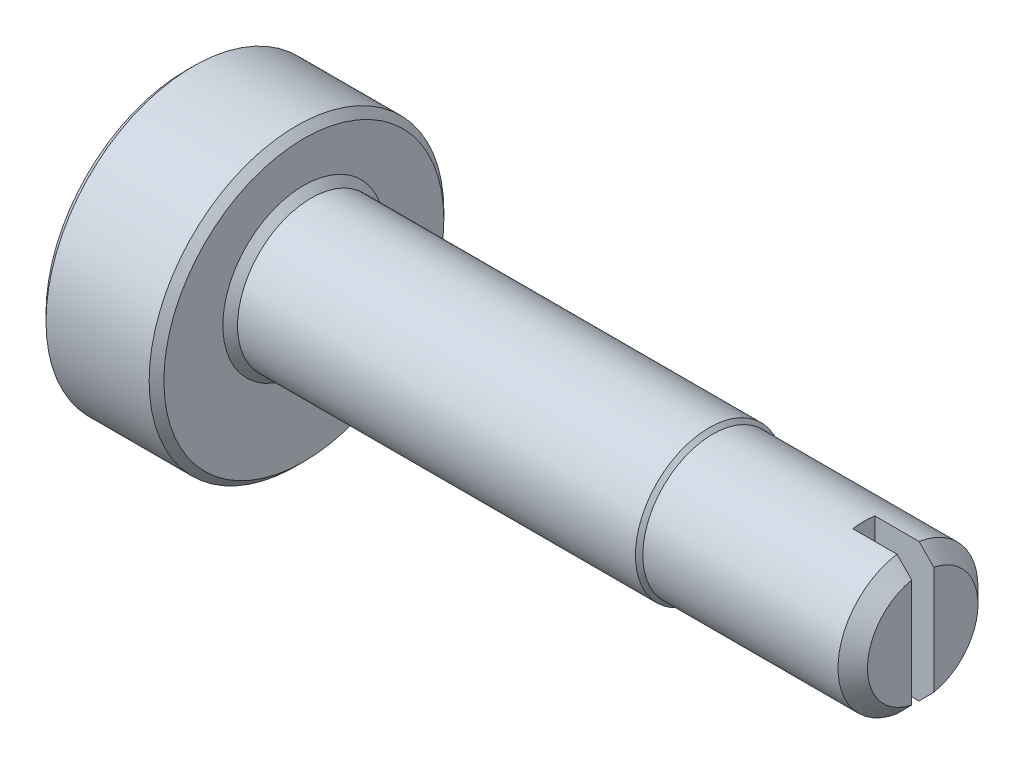
ISO-10303-21;
HEADER;
FILE_DESCRIPTION(('STEP AP214'),'2;1');
FILE_NAME('part.step','',(''),(''),'','','');
FILE_SCHEMA(('AUTOMOTIVE_DESIGN { 1 0 10303 214 1 1 1 1 }'));
ENDSEC;
DATA;
#1=APPLICATION_CONTEXT('core data for automotive mechanical design processes');
#2=APPLICATION_PROTOCOL_DEFINITION('international standard','automotive_design',2000,#1);
#3=PRODUCT_CONTEXT('',#1,'mechanical');
#4=PRODUCT('Part','Part','',(#3));
#5=PRODUCT_RELATED_PRODUCT_CATEGORY('part','',(#4));
#6=PRODUCT_DEFINITION_FORMATION('','',#4);
#7=PRODUCT_DEFINITION_CONTEXT('part definition',#1,'design');
#8=PRODUCT_DEFINITION('design','',#6,#7);
#9=PRODUCT_DEFINITION_SHAPE('','',#8);
#10=(LENGTH_UNIT() NAMED_UNIT(*) SI_UNIT(.MILLI.,.METRE.));
#11=(NAMED_UNIT(*) PLANE_ANGLE_UNIT() SI_UNIT($,.RADIAN.));
#12=(NAMED_UNIT(*) SI_UNIT($,.STERADIAN.) SOLID_ANGLE_UNIT());
#13=UNCERTAINTY_MEASURE_WITH_UNIT(LENGTH_MEASURE(1.E-05),#10,'distance_accuracy_value','');
#14=(GEOMETRIC_REPRESENTATION_CONTEXT(3) GLOBAL_UNCERTAINTY_ASSIGNED_CONTEXT((#13)) GLOBAL_UNIT_ASSIGNED_CONTEXT((#10,
#11,#12)) REPRESENTATION_CONTEXT('',''));
#15=CARTESIAN_POINT('',(0.,0.,0.));
#16=DIRECTION('',(0.,0.,1.));
#17=DIRECTION('',(1.,0.,0.));
#18=AXIS2_PLACEMENT_3D('',#15,#16,#17);
#19=CARTESIAN_POINT('',(10.,0.950000000000001,0.));
#20=DIRECTION('',(1.,0.,0.));
#21=DIRECTION('',(0.,0.,-1.));
#22=AXIS2_PLACEMENT_3D('',#19,#20,#21);
#23=PLANE('',#22);
#24=DIRECTION('',(0.,-1.,0.));
#25=VECTOR('',#24,1.);
#26=CARTESIAN_POINT('',(10.,0.,0.15));
#27=LINE('',#26,#25);
#28=CARTESIAN_POINT('',(10.,0.734846922834952,0.15));
#29=VERTEX_POINT('',#28);
#30=CARTESIAN_POINT('',(10.,-0.734846922834952,0.15));
#31=VERTEX_POINT('',#30);
#32=EDGE_CURVE('E381',#29,#31,#27,.T.);
#33=ORIENTED_EDGE('',*,*,#32,.F.);
#34=CARTESIAN_POINT('',(10.,0.,0.));
#35=DIRECTION('',(1.,0.,0.));
#36=DIRECTION('',(0.,0.,-1.));
#37=AXIS2_PLACEMENT_3D('',#34,#35,#36);
#38=CIRCLE('',#37,0.749999999999999);
#39=EDGE_CURVE('E382',#29,#31,#38,.T.);
#40=ORIENTED_EDGE('',*,*,#39,.T.);
#41=EDGE_LOOP('',(#33,#40));
#42=FACE_BOUND('',#41,.T.);
#43=ADVANCED_FACE('F202',(#42),#23,.T.);
#44=CARTESIAN_POINT('',(1.6,2.5,0.));
#45=DIRECTION('',(1.,0.,0.));
#46=DIRECTION('',(0.,0.,-1.));
#47=AXIS2_PLACEMENT_3D('',#44,#45,#46);
#48=PLANE('',#47);
#49=CARTESIAN_POINT('',(1.6,-0.25,0.));
#50=DIRECTION('',(1.,0.,0.));
#51=DIRECTION('',(0.,0.,-1.));
#52=AXIS2_PLACEMENT_3D('',#49,#50,#51);
#53=CIRCLE('',#52,1.9);
#54=CARTESIAN_POINT('',(1.6,-0.25,-1.9));
#55=VERTEX_POINT('',#54);
#56=EDGE_CURVE('E271',#55,#55,#53,.T.);
#57=ORIENTED_EDGE('',*,*,#56,.T.);
#58=EDGE_LOOP('',(#57));
#59=FACE_BOUND('',#58,.T.);
#60=CARTESIAN_POINT('',(1.6,0.,0.));
#61=DIRECTION('',(1.,0.,0.));
#62=DIRECTION('',(0.,0.,-1.));
#63=AXIS2_PLACEMENT_3D('',#60,#61,#62);
#64=CIRCLE('',#63,1.1);
#65=CARTESIAN_POINT('',(1.6,0.,-1.1));
#66=VERTEX_POINT('',#65);
#67=EDGE_CURVE('E419',#66,#66,#64,.T.);
#68=ORIENTED_EDGE('',*,*,#67,.F.);
#69=EDGE_LOOP('',(#68));
#70=FACE_BOUND('',#69,.T.);
#71=ADVANCED_FACE('F348',(#59,#70),#48,.T.);
#72=CARTESIAN_POINT('',(1.7,0.,0.));
#73=DIRECTION('',(-1.,0.,0.));
#74=DIRECTION('',(0.,0.,1.));
#75=AXIS2_PLACEMENT_3D('',#72,#73,#74);
#76=CONICAL_SURFACE('',#75,1.,0.785398163397448);
#77=ORIENTED_EDGE('',*,*,#67,.T.);
#78=EDGE_LOOP('',(#77));
#79=FACE_BOUND('',#78,.T.);
#80=CARTESIAN_POINT('',(1.7,0.,0.));
#81=DIRECTION('',(1.,0.,0.));
#82=DIRECTION('',(0.,0.,-1.));
#83=AXIS2_PLACEMENT_3D('',#80,#81,#82);
#84=CIRCLE('',#83,1.);
#85=CARTESIAN_POINT('',(1.7,0.,-1.));
#86=VERTEX_POINT('',#85);
#87=EDGE_CURVE('E416',#86,#86,#84,.T.);
#88=ORIENTED_EDGE('',*,*,#87,.F.);
#89=EDGE_LOOP('',(#88));
#90=FACE_BOUND('',#89,.T.);
#91=ADVANCED_FACE('F351',(#79,#90),#76,.T.);
#92=CARTESIAN_POINT('',(0.,0.,0.));
#93=DIRECTION('',(1.,0.,0.));
#94=DIRECTION('',(0.,0.,-1.));
#95=AXIS2_PLACEMENT_3D('',#92,#93,#94);
#96=CYLINDRICAL_SURFACE('',#95,1.);
#97=ORIENTED_EDGE('',*,*,#87,.T.);
#98=EDGE_LOOP('',(#97));
#99=FACE_BOUND('',#98,.T.);
#100=CARTESIAN_POINT('',(7.1,0.,0.));
#101=DIRECTION('',(1.,0.,0.));
#102=DIRECTION('',(0.,0.,-1.));
#103=AXIS2_PLACEMENT_3D('',#100,#101,#102);
#104=CIRCLE('',#103,1.);
#105=CARTESIAN_POINT('',(7.1,0.,-1.));
#106=VERTEX_POINT('',#105);
#107=EDGE_CURVE('E413',#106,#106,#104,.T.);
#108=ORIENTED_EDGE('',*,*,#107,.F.);
#109=EDGE_LOOP('',(#108));
#110=FACE_BOUND('',#109,.T.);
#111=ADVANCED_FACE('F355',(#99,#110),#96,.T.);
#112=CARTESIAN_POINT('',(7.15,0.,0.));
#113=DIRECTION('',(-1.,0.,0.));
#114=DIRECTION('',(0.,0.,1.));
#115=AXIS2_PLACEMENT_3D('',#112,#113,#114);
#116=CONICAL_SURFACE('',#115,0.950000000000001,0.785398163397445);
#117=ORIENTED_EDGE('',*,*,#107,.T.);
#118=EDGE_LOOP('',(#117));
#119=FACE_BOUND('',#118,.T.);
#120=CARTESIAN_POINT('',(7.15,0.,0.));
#121=DIRECTION('',(1.,0.,0.));
#122=DIRECTION('',(0.,0.,-1.));
#123=AXIS2_PLACEMENT_3D('',#120,#121,#122);
#124=CIRCLE('',#123,0.950000000000001);
#125=CARTESIAN_POINT('',(7.15,0.,-0.950000000000001));
#126=VERTEX_POINT('',#125);
#127=EDGE_CURVE('E405',#126,#126,#124,.T.);
#128=ORIENTED_EDGE('',*,*,#127,.F.);
#129=EDGE_LOOP('',(#128));
#130=FACE_BOUND('',#129,.T.);
#131=ADVANCED_FACE('F359',(#119,#130),#116,.T.);
#132=CARTESIAN_POINT('',(0.,0.,0.));
#133=DIRECTION('',(1.,0.,0.));
#134=DIRECTION('',(0.,0.,-1.));
#135=AXIS2_PLACEMENT_3D('',#132,#133,#134);
#136=CYLINDRICAL_SURFACE('',#135,0.950000000000001);
#137=DIRECTION('',(1.,0.,0.));
#138=VECTOR('',#137,1.);
#139=CARTESIAN_POINT('',(9.2,0.938083151964687,-0.15));
#140=LINE('',#139,#138);
#141=CARTESIAN_POINT('',(9.2,0.938083151964687,-0.15));
#142=VERTEX_POINT('',#141);
#143=CARTESIAN_POINT('',(9.8,0.938083151964687,-0.15));
#144=VERTEX_POINT('',#143);
#145=EDGE_CURVE('E403',#142,#144,#140,.T.);
#146=ORIENTED_EDGE('',*,*,#145,.T.);
#147=CARTESIAN_POINT('',(9.8,0.,0.));
#148=DIRECTION('',(1.,0.,0.));
#149=DIRECTION('',(0.,0.,-1.));
#150=AXIS2_PLACEMENT_3D('',#147,#148,#149);
#151=CIRCLE('',#150,0.950000000000001);
#152=CARTESIAN_POINT('',(9.8,-0.938083151964687,-0.15));
#153=VERTEX_POINT('',#152);
#154=EDGE_CURVE('E387',#144,#153,#151,.F.);
#155=ORIENTED_EDGE('',*,*,#154,.T.);
#156=DIRECTION('',(1.,0.,0.));
#157=VECTOR('',#156,1.);
#158=CARTESIAN_POINT('',(9.2,-0.938083151964687,-0.15));
#159=LINE('',#158,#157);
#160=CARTESIAN_POINT('',(9.2,-0.938083151964687,-0.15));
#161=VERTEX_POINT('',#160);
#162=EDGE_CURVE('E407',#161,#153,#159,.T.);
#163=ORIENTED_EDGE('',*,*,#162,.F.);
#164=CARTESIAN_POINT('',(9.2,0.,0.));
#165=DIRECTION('',(1.,0.,0.));
#166=DIRECTION('',(0.,0.,-1.));
#167=AXIS2_PLACEMENT_3D('',#164,#165,#166);
#168=CIRCLE('',#167,0.950000000000001);
#169=CARTESIAN_POINT('',(9.2,-0.938083151964687,0.15));
#170=VERTEX_POINT('',#169);
#171=EDGE_CURVE('E383',#170,#161,#168,.T.);
#172=ORIENTED_EDGE('',*,*,#171,.F.);
#173=DIRECTION('',(1.,0.,0.));
#174=VECTOR('',#173,1.);
#175=CARTESIAN_POINT('',(9.2,-0.938083151964687,0.15));
#176=LINE('',#175,#174);
#177=CARTESIAN_POINT('',(9.8,-0.938083151964687,0.15));
#178=VERTEX_POINT('',#177);
#179=EDGE_CURVE('E399',#170,#178,#176,.T.);
#180=ORIENTED_EDGE('',*,*,#179,.T.);
#181=CARTESIAN_POINT('',(9.8,0.,0.));
#182=DIRECTION('',(1.,0.,0.));
#183=DIRECTION('',(0.,0.,-1.));
#184=AXIS2_PLACEMENT_3D('',#181,#182,#183);
#185=CIRCLE('',#184,0.950000000000001);
#186=CARTESIAN_POINT('',(9.8,0.938083151964687,0.15));
#187=VERTEX_POINT('',#186);
#188=EDGE_CURVE('E338',#178,#187,#185,.F.);
#189=ORIENTED_EDGE('',*,*,#188,.T.);
#190=DIRECTION('',(1.,0.,0.));
#191=VECTOR('',#190,1.);
#192=CARTESIAN_POINT('',(9.2,0.938083151964687,0.15));
#193=LINE('',#192,#191);
#194=CARTESIAN_POINT('',(9.2,0.938083151964687,0.15));
#195=VERTEX_POINT('',#194);
#196=EDGE_CURVE('E397',#195,#187,#193,.T.);
#197=ORIENTED_EDGE('',*,*,#196,.F.);
#198=EDGE_CURVE('E428',#142,#195,#168,.T.);
#199=ORIENTED_EDGE('',*,*,#198,.F.);
#200=EDGE_LOOP('',(#146,#155,#163,#172,#180,#189,#197,#199));
#201=FACE_BOUND('',#200,.T.);
#202=ORIENTED_EDGE('',*,*,#127,.T.);
#203=EDGE_LOOP('',(#202));
#204=FACE_BOUND('',#203,.T.);
#205=ADVANCED_FACE('F363',(#201,#204),#136,.T.);
#206=DIRECTION('',(0.,1.,0.));
#207=VECTOR('',#206,1.);
#208=CARTESIAN_POINT('',(10.,0.,-0.15));
#209=LINE('',#208,#207);
#210=CARTESIAN_POINT('',(10.,-0.734846922834952,-0.15));
#211=VERTEX_POINT('',#210);
#212=CARTESIAN_POINT('',(10.,0.734846922834952,-0.15));
#213=VERTEX_POINT('',#212);
#214=EDGE_CURVE('E384',#211,#213,#209,.T.);
#215=ORIENTED_EDGE('',*,*,#214,.F.);
#216=CARTESIAN_POINT('',(10.,0.,0.));
#217=DIRECTION('',(1.,0.,0.));
#218=DIRECTION('',(0.,0.,-1.));
#219=AXIS2_PLACEMENT_3D('',#216,#217,#218);
#220=CIRCLE('',#219,0.749999999999999);
#221=EDGE_CURVE('E421',#211,#213,#220,.T.);
#222=ORIENTED_EDGE('',*,*,#221,.T.);
#223=EDGE_LOOP('',(#215,#222));
#224=FACE_BOUND('',#223,.T.);
#225=ADVANCED_FACE('F366',(#224),#23,.T.);
#226=CARTESIAN_POINT('',(10.001,-0.25,0.));
#227=DIRECTION('',(-1.,0.,0.));
#228=DIRECTION('',(0.,0.,1.));
#229=AXIS2_PLACEMENT_3D('',#226,#227,#228);
#230=CYLINDRICAL_SURFACE('',#229,2.);
#231=CARTESIAN_POINT('',(0.0999999999999977,-0.25,0.));
#232=DIRECTION('',(-1.,0.,0.));
#233=DIRECTION('',(0.,0.,1.));
#234=AXIS2_PLACEMENT_3D('',#231,#232,#233);
#235=CIRCLE('',#234,2.);
#236=CARTESIAN_POINT('',(0.0999999999999977,-0.25,2.));
#237=VERTEX_POINT('',#236);
#238=EDGE_CURVE('E286',#237,#237,#235,.F.);
#239=ORIENTED_EDGE('',*,*,#238,.T.);
#240=EDGE_LOOP('',(#239));
#241=FACE_BOUND('',#240,.T.);
#242=CARTESIAN_POINT('',(1.5,-0.25,0.));
#243=DIRECTION('',(1.,0.,0.));
#244=DIRECTION('',(0.,0.,-1.));
#245=AXIS2_PLACEMENT_3D('',#242,#243,#244);
#246=CIRCLE('',#245,2.);
#247=CARTESIAN_POINT('',(1.5,-0.25,-2.));
#248=VERTEX_POINT('',#247);
#249=EDGE_CURVE('E289',#248,#248,#246,.F.);
#250=ORIENTED_EDGE('',*,*,#249,.T.);
#251=EDGE_LOOP('',(#250));
#252=FACE_BOUND('',#251,.T.);
#253=ADVANCED_FACE('F323',(#241,#252),#230,.T.);
#254=CARTESIAN_POINT('',(0.,0.,0.));
#255=DIRECTION('',(-1.,0.,0.));
#256=DIRECTION('',(0.,0.,1.));
#257=AXIS2_PLACEMENT_3D('',#254,#255,#256);
#258=PLANE('',#257);
#259=DIRECTION('',(0.,1.,0.));
#260=VECTOR('',#259,1.);
#261=CARTESIAN_POINT('',(0.,0.,0.25));
#262=LINE('',#261,#260);
#263=CARTESIAN_POINT('',(0.,-1.95293863659264,0.25));
#264=VERTEX_POINT('',#263);
#265=CARTESIAN_POINT('',(0.,1.45293863659264,0.25));
#266=VERTEX_POINT('',#265);
#267=EDGE_CURVE('E12',#264,#266,#262,.T.);
#268=ORIENTED_EDGE('',*,*,#267,.F.);
#269=DIRECTION('',(0.,0.,-1.));
#270=VECTOR('',#269,1.);
#271=CARTESIAN_POINT('',(0.,-1.95293863659264,0.25));
#272=LINE('',#271,#270);
#273=CARTESIAN_POINT('',(0.,-1.95293863659264,-0.25));
#274=VERTEX_POINT('',#273);
#275=EDGE_CURVE('E270',#264,#274,#272,.T.);
#276=ORIENTED_EDGE('',*,*,#275,.T.);
#277=DIRECTION('',(0.,1.,0.));
#278=VECTOR('',#277,1.);
#279=CARTESIAN_POINT('',(0.,0.,-0.25));
#280=LINE('',#279,#278);
#281=CARTESIAN_POINT('',(0.,1.45293863659264,-0.25));
#282=VERTEX_POINT('',#281);
#283=EDGE_CURVE('E265',#274,#282,#280,.T.);
#284=ORIENTED_EDGE('',*,*,#283,.T.);
#285=DIRECTION('',(0.,0.,-1.));
#286=VECTOR('',#285,1.);
#287=CARTESIAN_POINT('',(0.,1.45293863659264,0.25));
#288=LINE('',#287,#286);
#289=EDGE_CURVE('E210',#282,#266,#288,.F.);
#290=ORIENTED_EDGE('',*,*,#289,.T.);
#291=EDGE_LOOP('',(#268,#276,#284,#290));
#292=FACE_BOUND('',#291,.T.);
#293=CARTESIAN_POINT('',(0.,-0.25,0.));
#294=DIRECTION('',(-1.,0.,0.));
#295=DIRECTION('',(0.,0.,1.));
#296=AXIS2_PLACEMENT_3D('',#293,#294,#295);
#297=CIRCLE('',#296,1.9);
#298=CARTESIAN_POINT('',(0.,-0.25,1.9));
#299=VERTEX_POINT('',#298);
#300=EDGE_CURVE('E292',#299,#299,#297,.T.);
#301=ORIENTED_EDGE('',*,*,#300,.T.);
#302=EDGE_LOOP('',(#301));
#303=FACE_BOUND('',#302,.T.);
#304=ADVANCED_FACE('F280',(#292,#303),#258,.T.);
#305=CARTESIAN_POINT('',(9.2,0.,0.15));
#306=DIRECTION('',(0.,0.,1.));
#307=DIRECTION('',(1.,0.,0.));
#308=AXIS2_PLACEMENT_3D('',#305,#306,#307);
#309=PLANE('',#308);
#310=ORIENTED_EDGE('',*,*,#32,.T.);
#311=CARTESIAN_POINT('',(10.,-0.734846922834952,0.15));
#312=CARTESIAN_POINT('',(9.96673165875972,-0.768783592104248,0.15));
#313=CARTESIAN_POINT('',(9.93343081966414,-0.802688280997369,0.15));
#314=CARTESIAN_POINT('',(9.86676415298339,-0.870433690693425,0.15));
#315=CARTESIAN_POINT('',(9.8333983254123,-0.904274411510215,0.15));
#316=CARTESIAN_POINT('',(9.8,-0.938083151964687,0.15));
#317=B_SPLINE_CURVE_WITH_KNOTS('',3,(#311,#312,#313,#314,#315,#316),.UNSPECIFIED.,.F.,.F.,(4,2,
4),(0.,0.142570208391093,0.285140385897235),.UNSPECIFIED.);
#318=EDGE_CURVE('E224',#31,#178,#317,.T.);
#319=ORIENTED_EDGE('',*,*,#318,.T.);
#320=ORIENTED_EDGE('',*,*,#179,.F.);
#321=DIRECTION('',(0.,-1.,0.));
#322=VECTOR('',#321,1.);
#323=CARTESIAN_POINT('',(9.2,0.,0.15));
#324=LINE('',#323,#322);
#325=EDGE_CURVE('E402',#195,#170,#324,.T.);
#326=ORIENTED_EDGE('',*,*,#325,.F.);
#327=ORIENTED_EDGE('',*,*,#196,.T.);
#328=CARTESIAN_POINT('',(9.8,0.938083151964687,0.15));
#329=CARTESIAN_POINT('',(9.8333983254123,0.904274411510215,0.15));
#330=CARTESIAN_POINT('',(9.86676415298339,0.870433690693425,0.15));
#331=CARTESIAN_POINT('',(9.93343081966414,0.802688280997369,0.15));
#332=CARTESIAN_POINT('',(9.96673165875972,0.768783592104248,0.15));
#333=CARTESIAN_POINT('',(10.,0.734846922834952,0.15));
#334=B_SPLINE_CURVE_WITH_KNOTS('',3,(#328,#329,#330,#331,#332,#333),.UNSPECIFIED.,.F.,.F.,(4,2,
4),(0.,0.142570177506142,0.285140385897235),.UNSPECIFIED.);
#335=EDGE_CURVE('E301',#187,#29,#334,.T.);
#336=ORIENTED_EDGE('',*,*,#335,.T.);
#337=EDGE_LOOP('',(#310,#319,#320,#326,#327,#336));
#338=FACE_BOUND('',#337,.T.);
#339=ADVANCED_FACE('F309',(#338),#309,.F.);
#340=CARTESIAN_POINT('',(9.2,0.,-0.15));
#341=DIRECTION('',(0.,0.,-1.));
#342=DIRECTION('',(-1.,0.,0.));
#343=AXIS2_PLACEMENT_3D('',#340,#341,#342);
#344=PLANE('',#343);
#345=ORIENTED_EDGE('',*,*,#214,.T.);
#346=CARTESIAN_POINT('',(10.,0.734846922834952,-0.15));
#347=CARTESIAN_POINT('',(9.96673165875972,0.768783592104248,-0.15));
#348=CARTESIAN_POINT('',(9.93343081966414,0.802688280997369,-0.15));
#349=CARTESIAN_POINT('',(9.86676415298339,0.870433690693425,-0.15));
#350=CARTESIAN_POINT('',(9.8333983254123,0.904274411510215,-0.15));
#351=CARTESIAN_POINT('',(9.8,0.938083151964687,-0.15));
#352=B_SPLINE_CURVE_WITH_KNOTS('',3,(#346,#347,#348,#349,#350,#351),.UNSPECIFIED.,.F.,.F.,(4,2,
4),(0.,0.142570208391093,0.285140385897235),.UNSPECIFIED.);
#353=EDGE_CURVE('E333',#213,#144,#352,.T.);
#354=ORIENTED_EDGE('',*,*,#353,.T.);
#355=ORIENTED_EDGE('',*,*,#145,.F.);
#356=DIRECTION('',(0.,1.,0.));
#357=VECTOR('',#356,1.);
#358=CARTESIAN_POINT('',(9.2,0.,-0.15));
#359=LINE('',#358,#357);
#360=EDGE_CURVE('E430',#161,#142,#359,.T.);
#361=ORIENTED_EDGE('',*,*,#360,.F.);
#362=ORIENTED_EDGE('',*,*,#162,.T.);
#363=CARTESIAN_POINT('',(9.8,-0.938083151964687,-0.15));
#364=CARTESIAN_POINT('',(9.8333983254123,-0.904274411510215,-0.15));
#365=CARTESIAN_POINT('',(9.86676415298339,-0.870433690693425,-0.15));
#366=CARTESIAN_POINT('',(9.93343081966414,-0.802688280997369,-0.15));
#367=CARTESIAN_POINT('',(9.96673165875972,-0.768783592104248,-0.15));
#368=CARTESIAN_POINT('',(10.,-0.734846922834952,-0.15));
#369=B_SPLINE_CURVE_WITH_KNOTS('',3,(#363,#364,#365,#366,#367,#368),.UNSPECIFIED.,.F.,.F.,(4,2,
4),(0.,0.142570177506142,0.285140385897235),.UNSPECIFIED.);
#370=EDGE_CURVE('E327',#153,#211,#369,.T.);
#371=ORIENTED_EDGE('',*,*,#370,.T.);
#372=EDGE_LOOP('',(#345,#354,#355,#361,#362,#371));
#373=FACE_BOUND('',#372,.T.);
#374=ADVANCED_FACE('F314',(#373),#344,.F.);
#375=CARTESIAN_POINT('',(9.2,0.,-2.23142135623731));
#376=DIRECTION('',(1.,0.,0.));
#377=DIRECTION('',(0.,0.,-1.));
#378=AXIS2_PLACEMENT_3D('',#375,#376,#377);
#379=PLANE('',#378);
#380=ORIENTED_EDGE('',*,*,#171,.T.);
#381=ORIENTED_EDGE('',*,*,#360,.T.);
#382=ORIENTED_EDGE('',*,*,#198,.T.);
#383=ORIENTED_EDGE('',*,*,#325,.T.);
#384=EDGE_LOOP('',(#380,#381,#382,#383));
#385=FACE_BOUND('',#384,.T.);
#386=ADVANCED_FACE('F316',(#385),#379,.T.);
#387=CARTESIAN_POINT('',(10.,0.,0.));
#388=DIRECTION('',(-1.,0.,0.));
#389=DIRECTION('',(0.,0.,1.));
#390=AXIS2_PLACEMENT_3D('',#387,#388,#389);
#391=CONICAL_SURFACE('',#390,0.749999999999999,0.785398163397452);
#392=ORIENTED_EDGE('',*,*,#370,.F.);
#393=ORIENTED_EDGE('',*,*,#154,.F.);
#394=ORIENTED_EDGE('',*,*,#353,.F.);
#395=ORIENTED_EDGE('',*,*,#221,.F.);
#396=EDGE_LOOP('',(#392,#393,#394,#395));
#397=FACE_BOUND('',#396,.T.);
#398=ADVANCED_FACE('F340',(#397),#391,.T.);
#399=CARTESIAN_POINT('',(10.,0.,0.));
#400=DIRECTION('',(-1.,0.,0.));
#401=DIRECTION('',(0.,0.,1.));
#402=AXIS2_PLACEMENT_3D('',#399,#400,#401);
#403=CONICAL_SURFACE('',#402,0.749999999999999,0.785398163397452);
#404=ORIENTED_EDGE('',*,*,#335,.F.);
#405=ORIENTED_EDGE('',*,*,#188,.F.);
#406=ORIENTED_EDGE('',*,*,#318,.F.);
#407=ORIENTED_EDGE('',*,*,#39,.F.);
#408=EDGE_LOOP('',(#404,#405,#406,#407));
#409=FACE_BOUND('',#408,.T.);
#410=ADVANCED_FACE('F306',(#409),#403,.T.);
#411=CARTESIAN_POINT('',(0.,-0.25,0.));
#412=DIRECTION('',(1.,0.,0.));
#413=DIRECTION('',(0.,0.,-1.));
#414=AXIS2_PLACEMENT_3D('',#411,#412,#413);
#415=CONICAL_SURFACE('',#414,1.9,0.785398163397448);
#416=ORIENTED_EDGE('',*,*,#238,.F.);
#417=EDGE_LOOP('',(#416));
#418=FACE_BOUND('',#417,.T.);
#419=ORIENTED_EDGE('',*,*,#300,.F.);
#420=EDGE_LOOP('',(#419));
#421=FACE_BOUND('',#420,.T.);
#422=ADVANCED_FACE('F452',(#418,#421),#415,.T.);
#423=CARTESIAN_POINT('',(1.5,-0.25,0.));
#424=DIRECTION('',(-1.,0.,0.));
#425=DIRECTION('',(0.,0.,1.));
#426=AXIS2_PLACEMENT_3D('',#423,#424,#425);
#427=CONICAL_SURFACE('',#426,2.,0.785398163397448);
#428=ORIENTED_EDGE('',*,*,#56,.F.);
#429=EDGE_LOOP('',(#428));
#430=FACE_BOUND('',#429,.T.);
#431=ORIENTED_EDGE('',*,*,#249,.F.);
#432=EDGE_LOOP('',(#431));
#433=FACE_BOUND('',#432,.T.);
#434=ADVANCED_FACE('F204',(#430,#433),#427,.T.);
#435=CARTESIAN_POINT('',(-3.425,-0.25,0.25));
#436=DIRECTION('',(0.,0.,-1.));
#437=DIRECTION('',(-1.,0.,0.));
#438=AXIS2_PLACEMENT_3D('',#435,#436,#437);
#439=CYLINDRICAL_SURFACE('',#438,3.825);
#440=CARTESIAN_POINT('',(-3.425,-0.25,-0.25));
#441=DIRECTION('',(0.,0.,1.));
#442=DIRECTION('',(1.,0.,0.));
#443=AXIS2_PLACEMENT_3D('',#440,#441,#442);
#444=CIRCLE('',#443,3.825);
#445=EDGE_CURVE('E216',#274,#282,#444,.T.);
#446=ORIENTED_EDGE('',*,*,#445,.F.);
#447=ORIENTED_EDGE('',*,*,#275,.F.);
#448=CARTESIAN_POINT('',(-3.425,-0.25,0.25));
#449=DIRECTION('',(0.,0.,1.));
#450=DIRECTION('',(1.,0.,0.));
#451=AXIS2_PLACEMENT_3D('',#448,#449,#450);
#452=CIRCLE('',#451,3.825);
#453=EDGE_CURVE('E277',#264,#266,#452,.T.);
#454=ORIENTED_EDGE('',*,*,#453,.T.);
#455=ORIENTED_EDGE('',*,*,#289,.F.);
#456=EDGE_LOOP('',(#446,#447,#454,#455));
#457=FACE_BOUND('',#456,.T.);
#458=ADVANCED_FACE('F274',(#457),#439,.F.);
#459=CARTESIAN_POINT('',(-3.425,-0.25,0.25));
#460=DIRECTION('',(0.,0.,1.));
#461=DIRECTION('',(1.,0.,0.));
#462=AXIS2_PLACEMENT_3D('',#459,#460,#461);
#463=PLANE('',#462);
#464=ORIENTED_EDGE('',*,*,#267,.T.);
#465=ORIENTED_EDGE('',*,*,#453,.F.);
#466=EDGE_LOOP('',(#464,#465));
#467=FACE_BOUND('',#466,.T.);
#468=ADVANCED_FACE('F472',(#467),#463,.F.);
#469=CARTESIAN_POINT('',(-3.425,-0.25,-0.25));
#470=DIRECTION('',(0.,0.,1.));
#471=DIRECTION('',(1.,0.,0.));
#472=AXIS2_PLACEMENT_3D('',#469,#470,#471);
#473=PLANE('',#472);
#474=ORIENTED_EDGE('',*,*,#445,.T.);
#475=ORIENTED_EDGE('',*,*,#283,.F.);
#476=EDGE_LOOP('',(#474,#475));
#477=FACE_BOUND('',#476,.T.);
#478=ADVANCED_FACE('F266',(#477),#473,.T.);
#479=CLOSED_SHELL('',(#43,#71,#91,#111,#131,#205,#225,#253,#304,#339,#374,#386,#398,#410,#422,
#434,#458,#468,#478));
#480=MANIFOLD_SOLID_BREP('B2',#479);
#481=ADVANCED_BREP_SHAPE_REPRESENTATION('',(#18,#480),#14);
#482=SHAPE_DEFINITION_REPRESENTATION(#9,#481);
ENDSEC;
END-ISO-10303-21;
